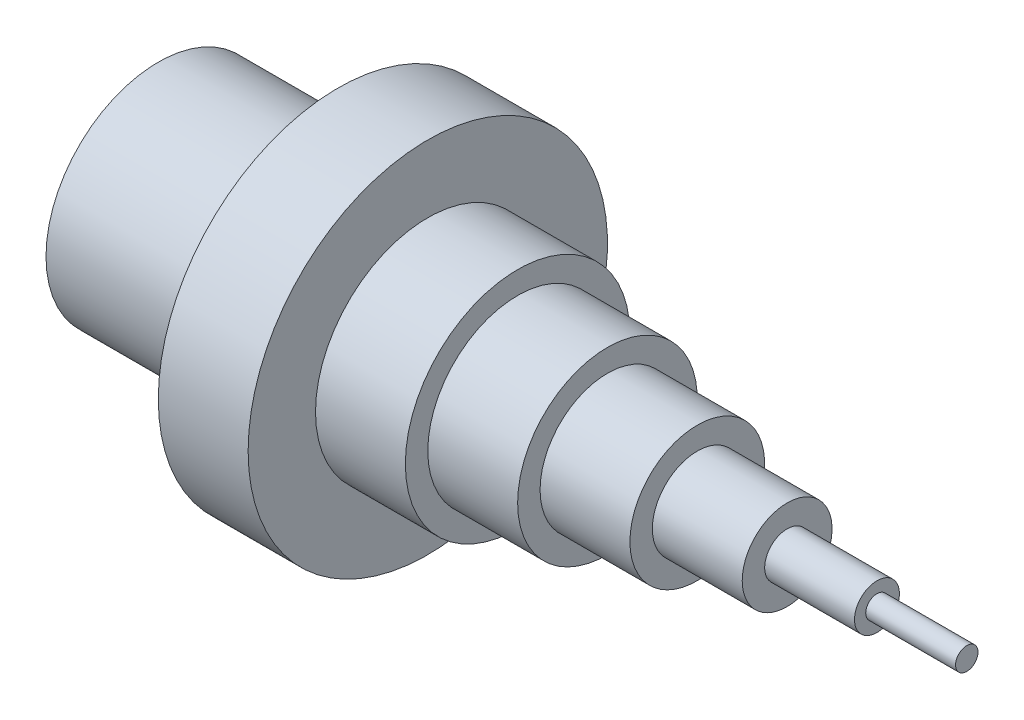
ISO-10303-21;
HEADER;
FILE_DESCRIPTION(('STEP AP214'),'2;1');
FILE_NAME('part.step','',(''),(''),'','','');
FILE_SCHEMA(('AUTOMOTIVE_DESIGN { 1 0 10303 214 1 1 1 1 }'));
ENDSEC;
DATA;
#1=APPLICATION_CONTEXT('core data for automotive mechanical design processes');
#2=APPLICATION_PROTOCOL_DEFINITION('international standard','automotive_design',2000,#1);
#3=PRODUCT_CONTEXT('',#1,'mechanical');
#4=PRODUCT('Part','Part','',(#3));
#5=PRODUCT_RELATED_PRODUCT_CATEGORY('part','',(#4));
#6=PRODUCT_DEFINITION_FORMATION('','',#4);
#7=PRODUCT_DEFINITION_CONTEXT('part definition',#1,'design');
#8=PRODUCT_DEFINITION('design','',#6,#7);
#9=PRODUCT_DEFINITION_SHAPE('','',#8);
#10=(LENGTH_UNIT() NAMED_UNIT(*) SI_UNIT(.MILLI.,.METRE.));
#11=(NAMED_UNIT(*) PLANE_ANGLE_UNIT() SI_UNIT($,.RADIAN.));
#12=(NAMED_UNIT(*) SI_UNIT($,.STERADIAN.) SOLID_ANGLE_UNIT());
#13=UNCERTAINTY_MEASURE_WITH_UNIT(LENGTH_MEASURE(1.E-05),#10,'distance_accuracy_value','');
#14=(GEOMETRIC_REPRESENTATION_CONTEXT(3) GLOBAL_UNCERTAINTY_ASSIGNED_CONTEXT((#13)) GLOBAL_UNIT_ASSIGNED_CONTEXT((#10,
#11,#12)) REPRESENTATION_CONTEXT('',''));
#15=CARTESIAN_POINT('',(0.,0.,0.));
#16=DIRECTION('',(0.,0.,1.));
#17=DIRECTION('',(1.,0.,0.));
#18=AXIS2_PLACEMENT_3D('',#15,#16,#17);
#19=CARTESIAN_POINT('',(1600.,0.,0.));
#20=DIRECTION('',(1.,0.,0.));
#21=DIRECTION('',(0.,0.,-1.));
#22=AXIS2_PLACEMENT_3D('',#19,#20,#21);
#23=PLANE('',#22);
#24=CARTESIAN_POINT('',(1600.,0.,0.));
#25=DIRECTION('',(-1.,0.,0.));
#26=DIRECTION('',(0.,0.,1.));
#27=AXIS2_PLACEMENT_3D('',#24,#25,#26);
#28=CIRCLE('',#27,25.);
#29=CARTESIAN_POINT('',(1600.,0.,25.));
#30=VERTEX_POINT('',#29);
#31=EDGE_CURVE('E89',#30,#30,#28,.T.);
#32=ORIENTED_EDGE('',*,*,#31,.T.);
#33=EDGE_LOOP('',(#32));
#34=FACE_BOUND('',#33,.T.);
#35=CARTESIAN_POINT('',(1600.,0.,0.));
#36=DIRECTION('',(-1.,0.,0.));
#37=DIRECTION('',(0.,0.,1.));
#38=AXIS2_PLACEMENT_3D('',#35,#36,#37);
#39=CIRCLE('',#38,50.);
#40=CARTESIAN_POINT('',(1600.,0.,50.));
#41=VERTEX_POINT('',#40);
#42=EDGE_CURVE('E10',#41,#41,#39,.T.);
#43=ORIENTED_EDGE('',*,*,#42,.F.);
#44=EDGE_LOOP('',(#43));
#45=FACE_BOUND('',#44,.T.);
#46=ADVANCED_FACE('F31',(#34,#45),#23,.T.);
#47=CARTESIAN_POINT('',(0.,0.,0.));
#48=DIRECTION('',(-1.,0.,0.));
#49=DIRECTION('',(0.,0.,1.));
#50=AXIS2_PLACEMENT_3D('',#47,#48,#49);
#51=CYLINDRICAL_SURFACE('',#50,50.);
#52=CARTESIAN_POINT('',(1400.,0.,0.));
#53=DIRECTION('',(-1.,0.,0.));
#54=DIRECTION('',(0.,0.,1.));
#55=AXIS2_PLACEMENT_3D('',#52,#53,#54);
#56=CIRCLE('',#55,50.);
#57=CARTESIAN_POINT('',(1400.,0.,50.));
#58=VERTEX_POINT('',#57);
#59=EDGE_CURVE('E37',#58,#58,#56,.T.);
#60=ORIENTED_EDGE('',*,*,#59,.F.);
#61=EDGE_LOOP('',(#60));
#62=FACE_BOUND('',#61,.T.);
#63=ORIENTED_EDGE('',*,*,#42,.T.);
#64=EDGE_LOOP('',(#63));
#65=FACE_BOUND('',#64,.T.);
#66=ADVANCED_FACE('F107',(#62,#65),#51,.T.);
#67=CARTESIAN_POINT('',(1400.,0.,0.));
#68=DIRECTION('',(1.,0.,0.));
#69=DIRECTION('',(0.,0.,-1.));
#70=AXIS2_PLACEMENT_3D('',#67,#68,#69);
#71=PLANE('',#70);
#72=ORIENTED_EDGE('',*,*,#59,.T.);
#73=EDGE_LOOP('',(#72));
#74=FACE_BOUND('',#73,.T.);
#75=CARTESIAN_POINT('',(1400.,0.,0.));
#76=DIRECTION('',(-1.,0.,0.));
#77=DIRECTION('',(0.,0.,1.));
#78=AXIS2_PLACEMENT_3D('',#75,#76,#77);
#79=CIRCLE('',#78,100.);
#80=CARTESIAN_POINT('',(1400.,0.,100.));
#81=VERTEX_POINT('',#80);
#82=EDGE_CURVE('E41',#81,#81,#79,.T.);
#83=ORIENTED_EDGE('',*,*,#82,.F.);
#84=EDGE_LOOP('',(#83));
#85=FACE_BOUND('',#84,.T.);
#86=ADVANCED_FACE('F111',(#74,#85),#71,.T.);
#87=CARTESIAN_POINT('',(0.,0.,0.));
#88=DIRECTION('',(-1.,0.,0.));
#89=DIRECTION('',(0.,0.,1.));
#90=AXIS2_PLACEMENT_3D('',#87,#88,#89);
#91=CYLINDRICAL_SURFACE('',#90,100.);
#92=ORIENTED_EDGE('',*,*,#82,.T.);
#93=EDGE_LOOP('',(#92));
#94=FACE_BOUND('',#93,.T.);
#95=CARTESIAN_POINT('',(1200.,0.,0.));
#96=DIRECTION('',(-1.,0.,0.));
#97=DIRECTION('',(0.,0.,1.));
#98=AXIS2_PLACEMENT_3D('',#95,#96,#97);
#99=CIRCLE('',#98,100.);
#100=CARTESIAN_POINT('',(1200.,0.,100.));
#101=VERTEX_POINT('',#100);
#102=EDGE_CURVE('E45',#101,#101,#99,.T.);
#103=ORIENTED_EDGE('',*,*,#102,.F.);
#104=EDGE_LOOP('',(#103));
#105=FACE_BOUND('',#104,.T.);
#106=ADVANCED_FACE('F116',(#94,#105),#91,.T.);
#107=CARTESIAN_POINT('',(1200.,0.,0.));
#108=DIRECTION('',(1.,0.,0.));
#109=DIRECTION('',(0.,0.,-1.));
#110=AXIS2_PLACEMENT_3D('',#107,#108,#109);
#111=PLANE('',#110);
#112=ORIENTED_EDGE('',*,*,#102,.T.);
#113=EDGE_LOOP('',(#112));
#114=FACE_BOUND('',#113,.T.);
#115=CARTESIAN_POINT('',(1200.,0.,0.));
#116=DIRECTION('',(-1.,0.,0.));
#117=DIRECTION('',(0.,0.,1.));
#118=AXIS2_PLACEMENT_3D('',#115,#116,#117);
#119=CIRCLE('',#118,150.);
#120=CARTESIAN_POINT('',(1200.,0.,150.));
#121=VERTEX_POINT('',#120);
#122=EDGE_CURVE('E50',#121,#121,#119,.T.);
#123=ORIENTED_EDGE('',*,*,#122,.F.);
#124=EDGE_LOOP('',(#123));
#125=FACE_BOUND('',#124,.T.);
#126=ADVANCED_FACE('F121',(#114,#125),#111,.T.);
#127=CARTESIAN_POINT('',(0.,0.,0.));
#128=DIRECTION('',(-1.,0.,0.));
#129=DIRECTION('',(0.,0.,1.));
#130=AXIS2_PLACEMENT_3D('',#127,#128,#129);
#131=CYLINDRICAL_SURFACE('',#130,150.);
#132=ORIENTED_EDGE('',*,*,#122,.T.);
#133=EDGE_LOOP('',(#132));
#134=FACE_BOUND('',#133,.T.);
#135=CARTESIAN_POINT('',(1000.,0.,0.));
#136=DIRECTION('',(-1.,0.,0.));
#137=DIRECTION('',(0.,0.,1.));
#138=AXIS2_PLACEMENT_3D('',#135,#136,#137);
#139=CIRCLE('',#138,150.);
#140=CARTESIAN_POINT('',(1000.,0.,150.));
#141=VERTEX_POINT('',#140);
#142=EDGE_CURVE('E53',#141,#141,#139,.T.);
#143=ORIENTED_EDGE('',*,*,#142,.F.);
#144=EDGE_LOOP('',(#143));
#145=FACE_BOUND('',#144,.T.);
#146=ADVANCED_FACE('F125',(#134,#145),#131,.T.);
#147=CARTESIAN_POINT('',(1000.,0.,0.));
#148=DIRECTION('',(1.,0.,0.));
#149=DIRECTION('',(0.,0.,-1.));
#150=AXIS2_PLACEMENT_3D('',#147,#148,#149);
#151=PLANE('',#150);
#152=ORIENTED_EDGE('',*,*,#142,.T.);
#153=EDGE_LOOP('',(#152));
#154=FACE_BOUND('',#153,.T.);
#155=CARTESIAN_POINT('',(1000.,0.,0.));
#156=DIRECTION('',(-1.,0.,0.));
#157=DIRECTION('',(0.,0.,1.));
#158=AXIS2_PLACEMENT_3D('',#155,#156,#157);
#159=CIRCLE('',#158,200.);
#160=CARTESIAN_POINT('',(1000.,0.,200.));
#161=VERTEX_POINT('',#160);
#162=EDGE_CURVE('E56',#161,#161,#159,.T.);
#163=ORIENTED_EDGE('',*,*,#162,.F.);
#164=EDGE_LOOP('',(#163));
#165=FACE_BOUND('',#164,.T.);
#166=ADVANCED_FACE('F129',(#154,#165),#151,.T.);
#167=CARTESIAN_POINT('',(0.,0.,0.));
#168=DIRECTION('',(-1.,0.,0.));
#169=DIRECTION('',(0.,0.,1.));
#170=AXIS2_PLACEMENT_3D('',#167,#168,#169);
#171=CYLINDRICAL_SURFACE('',#170,200.);
#172=ORIENTED_EDGE('',*,*,#162,.T.);
#173=EDGE_LOOP('',(#172));
#174=FACE_BOUND('',#173,.T.);
#175=CARTESIAN_POINT('',(800.,0.,0.));
#176=DIRECTION('',(-1.,0.,0.));
#177=DIRECTION('',(0.,0.,1.));
#178=AXIS2_PLACEMENT_3D('',#175,#176,#177);
#179=CIRCLE('',#178,200.);
#180=CARTESIAN_POINT('',(800.,0.,200.));
#181=VERTEX_POINT('',#180);
#182=EDGE_CURVE('E59',#181,#181,#179,.T.);
#183=ORIENTED_EDGE('',*,*,#182,.F.);
#184=EDGE_LOOP('',(#183));
#185=FACE_BOUND('',#184,.T.);
#186=ADVANCED_FACE('F133',(#174,#185),#171,.T.);
#187=CARTESIAN_POINT('',(800.,0.,0.));
#188=DIRECTION('',(1.,0.,0.));
#189=DIRECTION('',(0.,0.,-1.));
#190=AXIS2_PLACEMENT_3D('',#187,#188,#189);
#191=PLANE('',#190);
#192=ORIENTED_EDGE('',*,*,#182,.T.);
#193=EDGE_LOOP('',(#192));
#194=FACE_BOUND('',#193,.T.);
#195=CARTESIAN_POINT('',(800.,0.,0.));
#196=DIRECTION('',(-1.,0.,0.));
#197=DIRECTION('',(0.,0.,1.));
#198=AXIS2_PLACEMENT_3D('',#195,#196,#197);
#199=CIRCLE('',#198,250.);
#200=CARTESIAN_POINT('',(800.,0.,250.));
#201=VERTEX_POINT('',#200);
#202=EDGE_CURVE('E62',#201,#201,#199,.T.);
#203=ORIENTED_EDGE('',*,*,#202,.F.);
#204=EDGE_LOOP('',(#203));
#205=FACE_BOUND('',#204,.T.);
#206=ADVANCED_FACE('F137',(#194,#205),#191,.T.);
#207=CARTESIAN_POINT('',(0.,0.,0.));
#208=DIRECTION('',(-1.,0.,0.));
#209=DIRECTION('',(0.,0.,1.));
#210=AXIS2_PLACEMENT_3D('',#207,#208,#209);
#211=CYLINDRICAL_SURFACE('',#210,250.);
#212=ORIENTED_EDGE('',*,*,#202,.T.);
#213=EDGE_LOOP('',(#212));
#214=FACE_BOUND('',#213,.T.);
#215=CARTESIAN_POINT('',(600.,0.,0.));
#216=DIRECTION('',(-1.,0.,0.));
#217=DIRECTION('',(0.,0.,1.));
#218=AXIS2_PLACEMENT_3D('',#215,#216,#217);
#219=CIRCLE('',#218,250.);
#220=CARTESIAN_POINT('',(600.,0.,250.));
#221=VERTEX_POINT('',#220);
#222=EDGE_CURVE('E65',#221,#221,#219,.T.);
#223=ORIENTED_EDGE('',*,*,#222,.F.);
#224=EDGE_LOOP('',(#223));
#225=FACE_BOUND('',#224,.T.);
#226=ADVANCED_FACE('F141',(#214,#225),#211,.T.);
#227=CARTESIAN_POINT('',(600.,0.,0.));
#228=DIRECTION('',(1.,0.,0.));
#229=DIRECTION('',(0.,0.,-1.));
#230=AXIS2_PLACEMENT_3D('',#227,#228,#229);
#231=PLANE('',#230);
#232=ORIENTED_EDGE('',*,*,#222,.T.);
#233=EDGE_LOOP('',(#232));
#234=FACE_BOUND('',#233,.T.);
#235=CARTESIAN_POINT('',(600.,0.,0.));
#236=DIRECTION('',(-1.,0.,0.));
#237=DIRECTION('',(0.,0.,1.));
#238=AXIS2_PLACEMENT_3D('',#235,#236,#237);
#239=CIRCLE('',#238,400.);
#240=CARTESIAN_POINT('',(600.,0.,400.));
#241=VERTEX_POINT('',#240);
#242=EDGE_CURVE('E68',#241,#241,#239,.T.);
#243=ORIENTED_EDGE('',*,*,#242,.F.);
#244=EDGE_LOOP('',(#243));
#245=FACE_BOUND('',#244,.T.);
#246=ADVANCED_FACE('F145',(#234,#245),#231,.T.);
#247=CARTESIAN_POINT('',(0.,0.,0.));
#248=DIRECTION('',(-1.,0.,0.));
#249=DIRECTION('',(0.,0.,1.));
#250=AXIS2_PLACEMENT_3D('',#247,#248,#249);
#251=CYLINDRICAL_SURFACE('',#250,400.);
#252=ORIENTED_EDGE('',*,*,#242,.T.);
#253=EDGE_LOOP('',(#252));
#254=FACE_BOUND('',#253,.T.);
#255=CARTESIAN_POINT('',(400.,0.,0.));
#256=DIRECTION('',(-1.,0.,0.));
#257=DIRECTION('',(0.,0.,1.));
#258=AXIS2_PLACEMENT_3D('',#255,#256,#257);
#259=CIRCLE('',#258,400.);
#260=CARTESIAN_POINT('',(400.,0.,400.));
#261=VERTEX_POINT('',#260);
#262=EDGE_CURVE('E71',#261,#261,#259,.T.);
#263=ORIENTED_EDGE('',*,*,#262,.F.);
#264=EDGE_LOOP('',(#263));
#265=FACE_BOUND('',#264,.T.);
#266=ADVANCED_FACE('F149',(#254,#265),#251,.T.);
#267=CARTESIAN_POINT('',(400.,0.,0.));
#268=DIRECTION('',(-1.,0.,0.));
#269=DIRECTION('',(0.,0.,1.));
#270=AXIS2_PLACEMENT_3D('',#267,#268,#269);
#271=PLANE('',#270);
#272=ORIENTED_EDGE('',*,*,#262,.T.);
#273=EDGE_LOOP('',(#272));
#274=FACE_BOUND('',#273,.T.);
#275=CARTESIAN_POINT('',(400.,0.,0.));
#276=DIRECTION('',(-1.,0.,0.));
#277=DIRECTION('',(0.,0.,1.));
#278=AXIS2_PLACEMENT_3D('',#275,#276,#277);
#279=CIRCLE('',#278,250.);
#280=CARTESIAN_POINT('',(400.,0.,250.));
#281=VERTEX_POINT('',#280);
#282=EDGE_CURVE('E74',#281,#281,#279,.T.);
#283=ORIENTED_EDGE('',*,*,#282,.F.);
#284=EDGE_LOOP('',(#283));
#285=FACE_BOUND('',#284,.T.);
#286=ADVANCED_FACE('F153',(#274,#285),#271,.T.);
#287=CARTESIAN_POINT('',(0.,0.,0.));
#288=DIRECTION('',(-1.,0.,0.));
#289=DIRECTION('',(0.,0.,1.));
#290=AXIS2_PLACEMENT_3D('',#287,#288,#289);
#291=CYLINDRICAL_SURFACE('',#290,250.);
#292=ORIENTED_EDGE('',*,*,#282,.T.);
#293=EDGE_LOOP('',(#292));
#294=FACE_BOUND('',#293,.T.);
#295=CARTESIAN_POINT('',(0.,0.,0.));
#296=DIRECTION('',(-1.,0.,0.));
#297=DIRECTION('',(0.,0.,1.));
#298=AXIS2_PLACEMENT_3D('',#295,#296,#297);
#299=CIRCLE('',#298,250.);
#300=CARTESIAN_POINT('',(0.,0.,250.));
#301=VERTEX_POINT('',#300);
#302=EDGE_CURVE('E77',#301,#301,#299,.T.);
#303=ORIENTED_EDGE('',*,*,#302,.F.);
#304=EDGE_LOOP('',(#303));
#305=FACE_BOUND('',#304,.T.);
#306=ADVANCED_FACE('F157',(#294,#305),#291,.T.);
#307=CARTESIAN_POINT('',(0.,0.,0.));
#308=DIRECTION('',(-1.,0.,0.));
#309=DIRECTION('',(0.,0.,1.));
#310=AXIS2_PLACEMENT_3D('',#307,#308,#309);
#311=PLANE('',#310);
#312=ORIENTED_EDGE('',*,*,#302,.T.);
#313=EDGE_LOOP('',(#312));
#314=FACE_BOUND('',#313,.T.);
#315=CARTESIAN_POINT('',(0.,0.,0.));
#316=DIRECTION('',(-1.,0.,0.));
#317=DIRECTION('',(0.,0.,1.));
#318=AXIS2_PLACEMENT_3D('',#315,#316,#317);
#319=CIRCLE('',#318,200.);
#320=CARTESIAN_POINT('',(0.,0.,200.));
#321=VERTEX_POINT('',#320);
#322=EDGE_CURVE('E80',#321,#321,#319,.T.);
#323=ORIENTED_EDGE('',*,*,#322,.F.);
#324=EDGE_LOOP('',(#323));
#325=FACE_BOUND('',#324,.T.);
#326=ADVANCED_FACE('F161',(#314,#325),#311,.T.);
#327=CARTESIAN_POINT('',(0.,0.,0.));
#328=DIRECTION('',(-1.,0.,0.));
#329=DIRECTION('',(0.,0.,1.));
#330=AXIS2_PLACEMENT_3D('',#327,#328,#329);
#331=CYLINDRICAL_SURFACE('',#330,200.);
#332=ORIENTED_EDGE('',*,*,#322,.T.);
#333=EDGE_LOOP('',(#332));
#334=FACE_BOUND('',#333,.T.);
#335=CARTESIAN_POINT('',(400.,0.,0.));
#336=DIRECTION('',(-1.,0.,0.));
#337=DIRECTION('',(0.,0.,1.));
#338=AXIS2_PLACEMENT_3D('',#335,#336,#337);
#339=CIRCLE('',#338,200.);
#340=CARTESIAN_POINT('',(400.,0.,200.));
#341=VERTEX_POINT('',#340);
#342=EDGE_CURVE('E83',#341,#341,#339,.T.);
#343=ORIENTED_EDGE('',*,*,#342,.F.);
#344=EDGE_LOOP('',(#343));
#345=FACE_BOUND('',#344,.T.);
#346=ADVANCED_FACE('F165',(#334,#345),#331,.F.);
#347=CARTESIAN_POINT('',(400.,0.,0.));
#348=DIRECTION('',(-1.,0.,0.));
#349=DIRECTION('',(0.,0.,1.));
#350=AXIS2_PLACEMENT_3D('',#347,#348,#349);
#351=PLANE('',#350);
#352=ORIENTED_EDGE('',*,*,#342,.T.);
#353=EDGE_LOOP('',(#352));
#354=FACE_BOUND('',#353,.T.);
#355=ADVANCED_FACE('F103',(#354),#351,.T.);
#356=CARTESIAN_POINT('',(1800.,1.59872115546023E-11,0.));
#357=DIRECTION('',(1.,0.,0.));
#358=DIRECTION('',(0.,0.,-1.));
#359=AXIS2_PLACEMENT_3D('',#356,#357,#358);
#360=PLANE('',#359);
#361=CARTESIAN_POINT('',(1800.,0.,0.));
#362=DIRECTION('',(-1.,0.,0.));
#363=DIRECTION('',(0.,0.,1.));
#364=AXIS2_PLACEMENT_3D('',#361,#362,#363);
#365=CIRCLE('',#364,25.);
#366=CARTESIAN_POINT('',(1800.,0.,25.));
#367=VERTEX_POINT('',#366);
#368=EDGE_CURVE('E86',#367,#367,#365,.T.);
#369=ORIENTED_EDGE('',*,*,#368,.F.);
#370=EDGE_LOOP('',(#369));
#371=FACE_BOUND('',#370,.T.);
#372=ADVANCED_FACE('F97',(#371),#360,.T.);
#373=CARTESIAN_POINT('',(0.,0.,0.));
#374=DIRECTION('',(-1.,0.,0.));
#375=DIRECTION('',(0.,0.,1.));
#376=AXIS2_PLACEMENT_3D('',#373,#374,#375);
#377=CYLINDRICAL_SURFACE('',#376,25.);
#378=ORIENTED_EDGE('',*,*,#368,.T.);
#379=EDGE_LOOP('',(#378));
#380=FACE_BOUND('',#379,.T.);
#381=ORIENTED_EDGE('',*,*,#31,.F.);
#382=EDGE_LOOP('',(#381));
#383=FACE_BOUND('',#382,.T.);
#384=ADVANCED_FACE('F95',(#380,#383),#377,.T.);
#385=CLOSED_SHELL('',(#46,#66,#86,#106,#126,#146,#166,#186,#206,#226,#246,#266,#286,#306,#326,
#346,#355,#372,#384));
#386=MANIFOLD_SOLID_BREP('B2',#385);
#387=ADVANCED_BREP_SHAPE_REPRESENTATION('',(#18,#386),#14);
#388=SHAPE_DEFINITION_REPRESENTATION(#9,#387);
ENDSEC;
END-ISO-10303-21;
